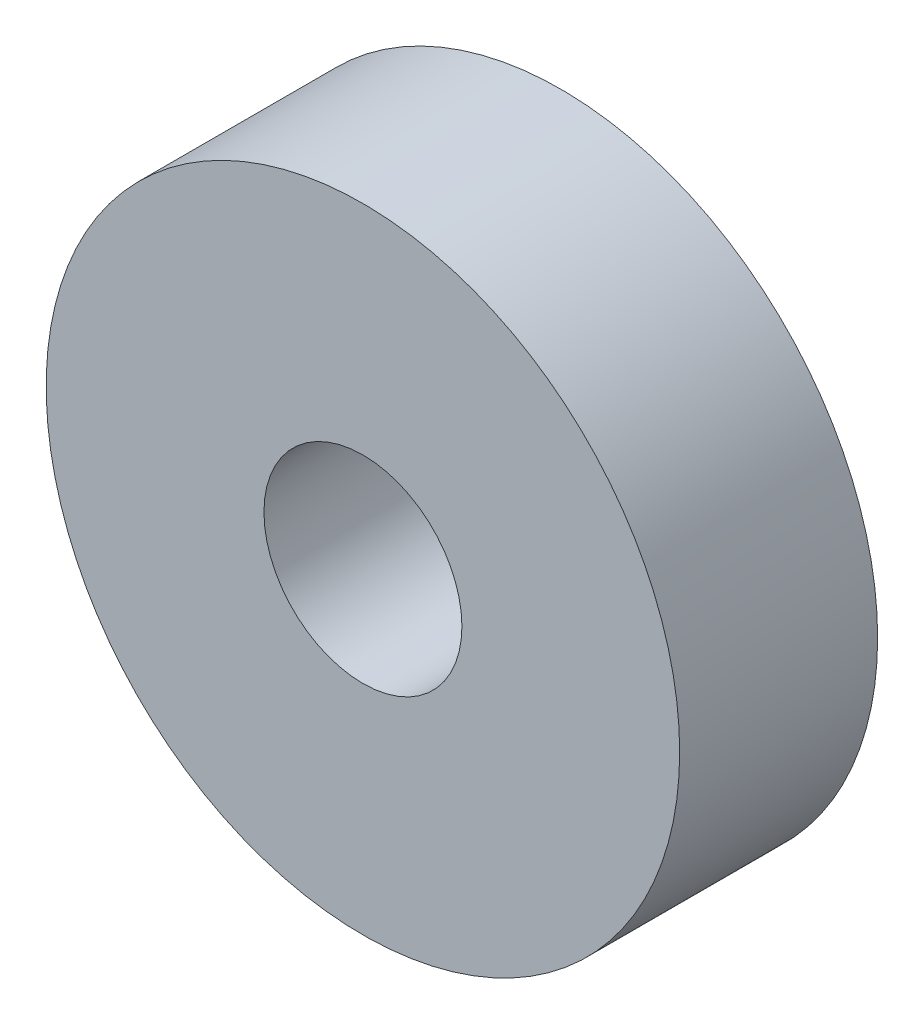
ISO-10303-21;
HEADER;
FILE_DESCRIPTION(('STEP AP214'),'2;1');
FILE_NAME('part.step','',(''),(''),'','','');
FILE_SCHEMA(('AUTOMOTIVE_DESIGN { 1 0 10303 214 1 1 1 1 }'));
ENDSEC;
DATA;
#1=APPLICATION_CONTEXT('core data for automotive mechanical design processes');
#2=APPLICATION_PROTOCOL_DEFINITION('international standard','automotive_design',2000,#1);
#3=PRODUCT_CONTEXT('',#1,'mechanical');
#4=PRODUCT('Part','Part','',(#3));
#5=PRODUCT_RELATED_PRODUCT_CATEGORY('part','',(#4));
#6=PRODUCT_DEFINITION_FORMATION('','',#4);
#7=PRODUCT_DEFINITION_CONTEXT('part definition',#1,'design');
#8=PRODUCT_DEFINITION('design','',#6,#7);
#9=PRODUCT_DEFINITION_SHAPE('','',#8);
#10=(LENGTH_UNIT() NAMED_UNIT(*) SI_UNIT(.MILLI.,.METRE.));
#11=(NAMED_UNIT(*) PLANE_ANGLE_UNIT() SI_UNIT($,.RADIAN.));
#12=(NAMED_UNIT(*) SI_UNIT($,.STERADIAN.) SOLID_ANGLE_UNIT());
#13=UNCERTAINTY_MEASURE_WITH_UNIT(LENGTH_MEASURE(1.E-05),#10,'distance_accuracy_value','');
#14=(GEOMETRIC_REPRESENTATION_CONTEXT(3) GLOBAL_UNCERTAINTY_ASSIGNED_CONTEXT((#13)) GLOBAL_UNIT_ASSIGNED_CONTEXT((#10,
#11,#12)) REPRESENTATION_CONTEXT('',''));
#15=CARTESIAN_POINT('',(0.,0.,0.));
#16=DIRECTION('',(0.,0.,1.));
#17=DIRECTION('',(1.,0.,0.));
#18=AXIS2_PLACEMENT_3D('',#15,#16,#17);
#19=CARTESIAN_POINT('',(0.,0.,5.));
#20=DIRECTION('',(0.,0.,1.));
#21=DIRECTION('',(1.,0.,0.));
#22=AXIS2_PLACEMENT_3D('',#19,#20,#21);
#23=PLANE('',#22);
#24=CARTESIAN_POINT('',(0.,0.,5.));
#25=DIRECTION('',(0.,0.,1.));
#26=DIRECTION('',(1.,0.,0.));
#27=AXIS2_PLACEMENT_3D('',#24,#25,#26);
#28=CIRCLE('',#27,8.);
#29=CARTESIAN_POINT('',(8.,0.,5.));
#30=VERTEX_POINT('',#29);
#31=EDGE_CURVE('E10',#30,#30,#28,.T.);
#32=ORIENTED_EDGE('',*,*,#31,.T.);
#33=EDGE_LOOP('',(#32));
#34=FACE_BOUND('',#33,.T.);
#35=CARTESIAN_POINT('',(0.,0.,5.));
#36=DIRECTION('',(0.,0.,1.));
#37=DIRECTION('',(1.,0.,0.));
#38=AXIS2_PLACEMENT_3D('',#35,#36,#37);
#39=CIRCLE('',#38,2.5);
#40=CARTESIAN_POINT('',(2.5,0.,5.));
#41=VERTEX_POINT('',#40);
#42=EDGE_CURVE('E42',#41,#41,#39,.T.);
#43=ORIENTED_EDGE('',*,*,#42,.F.);
#44=EDGE_LOOP('',(#43));
#45=FACE_BOUND('',#44,.T.);
#46=ADVANCED_FACE('F31',(#34,#45),#23,.T.);
#47=CARTESIAN_POINT('',(0.,0.,0.));
#48=DIRECTION('',(0.,0.,1.));
#49=DIRECTION('',(1.,0.,0.));
#50=AXIS2_PLACEMENT_3D('',#47,#48,#49);
#51=PLANE('',#50);
#52=CARTESIAN_POINT('',(0.,0.,0.));
#53=DIRECTION('',(0.,0.,1.));
#54=DIRECTION('',(1.,0.,0.));
#55=AXIS2_PLACEMENT_3D('',#52,#53,#54);
#56=CIRCLE('',#55,8.);
#57=CARTESIAN_POINT('',(8.,0.,0.));
#58=VERTEX_POINT('',#57);
#59=EDGE_CURVE('E35',#58,#58,#56,.T.);
#60=ORIENTED_EDGE('',*,*,#59,.F.);
#61=EDGE_LOOP('',(#60));
#62=FACE_BOUND('',#61,.T.);
#63=CARTESIAN_POINT('',(0.,0.,0.));
#64=DIRECTION('',(0.,0.,1.));
#65=DIRECTION('',(1.,0.,0.));
#66=AXIS2_PLACEMENT_3D('',#63,#64,#65);
#67=CIRCLE('',#66,2.5);
#68=CARTESIAN_POINT('',(2.5,0.,0.));
#69=VERTEX_POINT('',#68);
#70=EDGE_CURVE('E44',#69,#69,#67,.T.);
#71=ORIENTED_EDGE('',*,*,#70,.T.);
#72=EDGE_LOOP('',(#71));
#73=FACE_BOUND('',#72,.T.);
#74=ADVANCED_FACE('F54',(#62,#73),#51,.F.);
#75=CARTESIAN_POINT('',(0.,0.,5.));
#76=DIRECTION('',(0.,0.,-1.));
#77=DIRECTION('',(-1.,0.,0.));
#78=AXIS2_PLACEMENT_3D('',#75,#76,#77);
#79=CYLINDRICAL_SURFACE('',#78,8.);
#80=ORIENTED_EDGE('',*,*,#31,.F.);
#81=EDGE_LOOP('',(#80));
#82=FACE_BOUND('',#81,.T.);
#83=ORIENTED_EDGE('',*,*,#59,.T.);
#84=EDGE_LOOP('',(#83));
#85=FACE_BOUND('',#84,.T.);
#86=ADVANCED_FACE('F33',(#82,#85),#79,.T.);
#87=CARTESIAN_POINT('',(0.,0.,5.));
#88=DIRECTION('',(0.,0.,-1.));
#89=DIRECTION('',(-1.,0.,0.));
#90=AXIS2_PLACEMENT_3D('',#87,#88,#89);
#91=CYLINDRICAL_SURFACE('',#90,2.5);
#92=ORIENTED_EDGE('',*,*,#42,.T.);
#93=EDGE_LOOP('',(#92));
#94=FACE_BOUND('',#93,.T.);
#95=ORIENTED_EDGE('',*,*,#70,.F.);
#96=EDGE_LOOP('',(#95));
#97=FACE_BOUND('',#96,.T.);
#98=ADVANCED_FACE('F50',(#94,#97),#91,.F.);
#99=CLOSED_SHELL('',(#46,#74,#86,#98));
#100=MANIFOLD_SOLID_BREP('B2',#99);
#101=ADVANCED_BREP_SHAPE_REPRESENTATION('',(#18,#100),#14);
#102=SHAPE_DEFINITION_REPRESENTATION(#9,#101);
ENDSEC;
END-ISO-10303-21;
